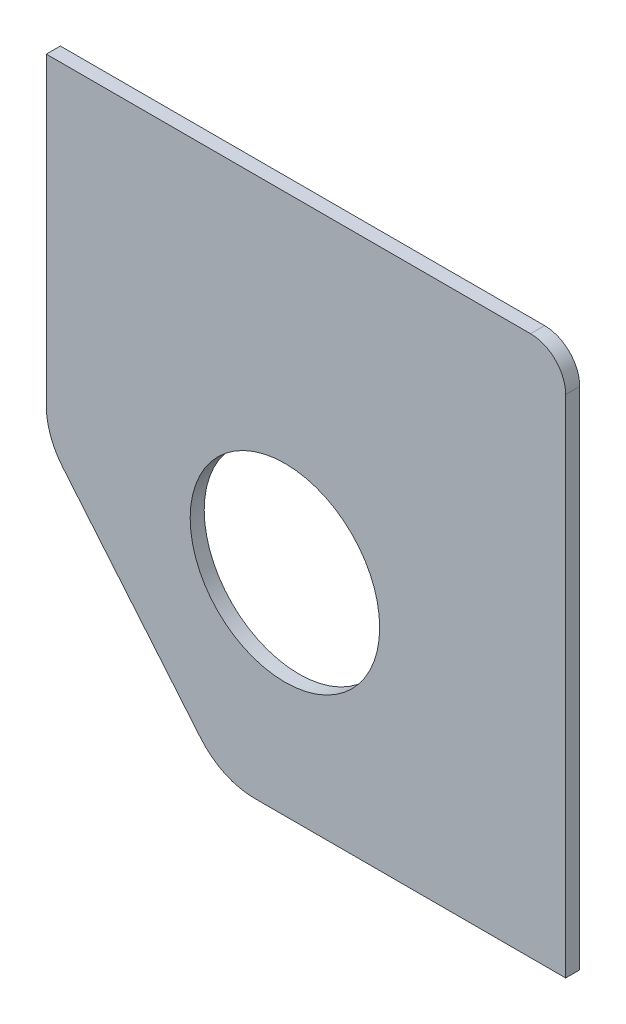
ISO-10303-21;
HEADER;
FILE_DESCRIPTION(('STEP AP214'),'2;1');
FILE_NAME('part.step','',(''),(''),'','','');
FILE_SCHEMA(('AUTOMOTIVE_DESIGN { 1 0 10303 214 1 1 1 1 }'));
ENDSEC;
DATA;
#1=APPLICATION_CONTEXT('core data for automotive mechanical design processes');
#2=APPLICATION_PROTOCOL_DEFINITION('international standard','automotive_design',2000,#1);
#3=PRODUCT_CONTEXT('',#1,'mechanical');
#4=PRODUCT('Part','Part','',(#3));
#5=PRODUCT_RELATED_PRODUCT_CATEGORY('part','',(#4));
#6=PRODUCT_DEFINITION_FORMATION('','',#4);
#7=PRODUCT_DEFINITION_CONTEXT('part definition',#1,'design');
#8=PRODUCT_DEFINITION('design','',#6,#7);
#9=PRODUCT_DEFINITION_SHAPE('','',#8);
#10=(LENGTH_UNIT() NAMED_UNIT(*) SI_UNIT(.MILLI.,.METRE.));
#11=(NAMED_UNIT(*) PLANE_ANGLE_UNIT() SI_UNIT($,.RADIAN.));
#12=(NAMED_UNIT(*) SI_UNIT($,.STERADIAN.) SOLID_ANGLE_UNIT());
#13=UNCERTAINTY_MEASURE_WITH_UNIT(LENGTH_MEASURE(1.E-05),#10,'distance_accuracy_value','');
#14=(GEOMETRIC_REPRESENTATION_CONTEXT(3) GLOBAL_UNCERTAINTY_ASSIGNED_CONTEXT((#13)) GLOBAL_UNIT_ASSIGNED_CONTEXT((#10,
#11,#12)) REPRESENTATION_CONTEXT('',''));
#15=CARTESIAN_POINT('',(0.,0.,0.));
#16=DIRECTION('',(0.,0.,1.));
#17=DIRECTION('',(1.,0.,0.));
#18=AXIS2_PLACEMENT_3D('',#15,#16,#17);
#19=CARTESIAN_POINT('',(-10.0111395817895,-38.1455223880597,2.));
#20=DIRECTION('',(0.,0.,-1.));
#21=DIRECTION('',(-1.,0.,0.));
#22=AXIS2_PLACEMENT_3D('',#19,#20,#21);
#23=CYLINDRICAL_SURFACE('',#22,10.);
#24=DIRECTION('',(0.,0.,-1.));
#25=VECTOR('',#24,1.);
#26=CARTESIAN_POINT('',(-10.0111395817895,-48.1455223880597,2.));
#27=LINE('',#26,#25);
#28=CARTESIAN_POINT('',(-10.0111395817895,-48.1455223880597,2.));
#29=VERTEX_POINT('',#28);
#30=CARTESIAN_POINT('',(-10.0111395817895,-48.1455223880597,0.));
#31=VERTEX_POINT('',#30);
#32=EDGE_CURVE('E155',#29,#31,#27,.T.);
#33=ORIENTED_EDGE('',*,*,#32,.F.);
#34=CARTESIAN_POINT('',(-10.0111395817895,-38.1455223880597,2.));
#35=DIRECTION('',(0.,0.,1.));
#36=DIRECTION('',(1.,0.,0.));
#37=AXIS2_PLACEMENT_3D('',#34,#35,#36);
#38=CIRCLE('',#37,10.);
#39=CARTESIAN_POINT('',(-17.6933523777633,-44.5473663847045,2.));
#40=VERTEX_POINT('',#39);
#41=EDGE_CURVE('E40',#40,#29,#38,.T.);
#42=ORIENTED_EDGE('',*,*,#41,.F.);
#43=DIRECTION('',(0.,0.,-1.));
#44=VECTOR('',#43,1.);
#45=CARTESIAN_POINT('',(-17.6933523777633,-44.5473663847045,138.016150708444));
#46=LINE('',#45,#44);
#47=CARTESIAN_POINT('',(-17.6933523777633,-44.5473663847045,0.));
#48=VERTEX_POINT('',#47);
#49=EDGE_CURVE('E157',#48,#40,#46,.F.);
#50=ORIENTED_EDGE('',*,*,#49,.F.);
#51=CARTESIAN_POINT('',(-10.0111395817895,-38.1455223880597,0.));
#52=DIRECTION('',(0.,0.,1.));
#53=DIRECTION('',(1.,0.,0.));
#54=AXIS2_PLACEMENT_3D('',#51,#52,#53);
#55=CIRCLE('',#54,10.);
#56=EDGE_CURVE('E11',#31,#48,#55,.F.);
#57=ORIENTED_EDGE('',*,*,#56,.F.);
#58=EDGE_LOOP('',(#33,#42,#50,#57));
#59=FACE_BOUND('',#58,.T.);
#60=ADVANCED_FACE('F33',(#59),#23,.T.);
#61=CARTESIAN_POINT('',(-29.6948890416339,-14.5250230362464,2.));
#62=DIRECTION('',(0.,0.,1.));
#63=DIRECTION('',(1.,0.,0.));
#64=AXIS2_PLACEMENT_3D('',#61,#62,#63);
#65=CYLINDRICAL_SURFACE('',#64,10.);
#66=DIRECTION('',(0.,0.,1.));
#67=VECTOR('',#66,1.);
#68=CARTESIAN_POINT('',(-39.6948890416339,-14.5250230362464,2.));
#69=LINE('',#68,#67);
#70=CARTESIAN_POINT('',(-39.6948890416339,-14.5250230362464,0.));
#71=VERTEX_POINT('',#70);
#72=CARTESIAN_POINT('',(-39.6948890416339,-14.5250230362464,2.));
#73=VERTEX_POINT('',#72);
#74=EDGE_CURVE('E144',#71,#73,#69,.T.);
#75=ORIENTED_EDGE('',*,*,#74,.F.);
#76=CARTESIAN_POINT('',(-29.6948890416339,-14.5250230362464,0.));
#77=DIRECTION('',(0.,0.,1.));
#78=DIRECTION('',(1.,0.,0.));
#79=AXIS2_PLACEMENT_3D('',#76,#77,#78);
#80=CIRCLE('',#79,10.);
#81=CARTESIAN_POINT('',(-37.3771018376077,-20.9268670328912,0.));
#82=VERTEX_POINT('',#81);
#83=EDGE_CURVE('E150',#82,#71,#80,.F.);
#84=ORIENTED_EDGE('',*,*,#83,.F.);
#85=DIRECTION('',(0.,0.,1.));
#86=VECTOR('',#85,1.);
#87=CARTESIAN_POINT('',(-37.3771018376077,-20.9268670328912,138.016150708444));
#88=LINE('',#87,#86);
#89=CARTESIAN_POINT('',(-37.3771018376077,-20.9268670328912,2.));
#90=VERTEX_POINT('',#89);
#91=EDGE_CURVE('E147',#90,#82,#88,.F.);
#92=ORIENTED_EDGE('',*,*,#91,.F.);
#93=CARTESIAN_POINT('',(-29.6948890416339,-14.5250230362464,2.));
#94=DIRECTION('',(0.,0.,1.));
#95=DIRECTION('',(1.,0.,0.));
#96=AXIS2_PLACEMENT_3D('',#93,#94,#95);
#97=CIRCLE('',#96,10.);
#98=EDGE_CURVE('E152',#73,#90,#97,.T.);
#99=ORIENTED_EDGE('',*,*,#98,.F.);
#100=EDGE_LOOP('',(#75,#84,#92,#99));
#101=FACE_BOUND('',#100,.T.);
#102=ADVANCED_FACE('F179',(#101),#65,.T.);
#103=CARTESIAN_POINT('',(29.3051109583661,23.8544776119403,2.));
#104=DIRECTION('',(0.,0.,1.));
#105=DIRECTION('',(1.,0.,0.));
#106=AXIS2_PLACEMENT_3D('',#103,#104,#105);
#107=CYLINDRICAL_SURFACE('',#106,5.);
#108=DIRECTION('',(0.,0.,1.));
#109=VECTOR('',#108,1.);
#110=CARTESIAN_POINT('',(34.3051109583661,23.8544776119403,2.));
#111=LINE('',#110,#109);
#112=CARTESIAN_POINT('',(34.3051109583661,23.8544776119403,0.));
#113=VERTEX_POINT('',#112);
#114=CARTESIAN_POINT('',(34.3051109583661,23.8544776119403,2.));
#115=VERTEX_POINT('',#114);
#116=EDGE_CURVE('E118',#113,#115,#111,.T.);
#117=ORIENTED_EDGE('',*,*,#116,.F.);
#118=CARTESIAN_POINT('',(29.3051109583661,23.8544776119403,0.));
#119=DIRECTION('',(0.,0.,1.));
#120=DIRECTION('',(1.,0.,0.));
#121=AXIS2_PLACEMENT_3D('',#118,#119,#120);
#122=CIRCLE('',#121,5.);
#123=CARTESIAN_POINT('',(29.3051109583661,28.8544776119403,0.));
#124=VERTEX_POINT('',#123);
#125=EDGE_CURVE('E140',#124,#113,#122,.F.);
#126=ORIENTED_EDGE('',*,*,#125,.F.);
#127=DIRECTION('',(0.,0.,1.));
#128=VECTOR('',#127,1.);
#129=CARTESIAN_POINT('',(29.3051109583661,28.8544776119403,2.));
#130=LINE('',#129,#128);
#131=CARTESIAN_POINT('',(29.3051109583661,28.8544776119403,2.));
#132=VERTEX_POINT('',#131);
#133=EDGE_CURVE('E137',#132,#124,#130,.F.);
#134=ORIENTED_EDGE('',*,*,#133,.F.);
#135=CARTESIAN_POINT('',(29.3051109583661,23.8544776119403,2.));
#136=DIRECTION('',(0.,0.,1.));
#137=DIRECTION('',(1.,0.,0.));
#138=AXIS2_PLACEMENT_3D('',#135,#136,#137);
#139=CIRCLE('',#138,5.);
#140=EDGE_CURVE('E142',#115,#132,#139,.T.);
#141=ORIENTED_EDGE('',*,*,#140,.F.);
#142=EDGE_LOOP('',(#117,#126,#134,#141));
#143=FACE_BOUND('',#142,.T.);
#144=ADVANCED_FACE('F186',(#143),#107,.T.);
#145=CARTESIAN_POINT('',(-39.6948890416339,28.8544776119403,2.));
#146=DIRECTION('',(1.,0.,0.));
#147=DIRECTION('',(0.,0.,-1.));
#148=AXIS2_PLACEMENT_3D('',#145,#146,#147);
#149=PLANE('',#148);
#150=DIRECTION('',(0.,-1.,0.));
#151=VECTOR('',#150,1.);
#152=CARTESIAN_POINT('',(-39.6948890416339,28.8544776119403,0.));
#153=LINE('',#152,#151);
#154=CARTESIAN_POINT('',(-39.6948890416339,28.8544776119403,0.));
#155=VERTEX_POINT('',#154);
#156=EDGE_CURVE('E124',#155,#71,#153,.T.);
#157=ORIENTED_EDGE('',*,*,#156,.T.);
#158=ORIENTED_EDGE('',*,*,#74,.T.);
#159=DIRECTION('',(0.,-1.,0.));
#160=VECTOR('',#159,1.);
#161=CARTESIAN_POINT('',(-39.6948890416339,28.8544776119403,2.));
#162=LINE('',#161,#160);
#163=CARTESIAN_POINT('',(-39.6948890416339,28.8544776119403,2.));
#164=VERTEX_POINT('',#163);
#165=EDGE_CURVE('E103',#164,#73,#162,.T.);
#166=ORIENTED_EDGE('',*,*,#165,.F.);
#167=DIRECTION('',(0.,0.,-1.));
#168=VECTOR('',#167,1.);
#169=CARTESIAN_POINT('',(-39.6948890416339,28.8544776119403,2.));
#170=LINE('',#169,#168);
#171=EDGE_CURVE('E113',#164,#155,#170,.T.);
#172=ORIENTED_EDGE('',*,*,#171,.T.);
#173=EDGE_LOOP('',(#157,#158,#166,#172));
#174=FACE_BOUND('',#173,.T.);
#175=ADVANCED_FACE('F174',(#174),#149,.F.);
#176=CARTESIAN_POINT('',(-39.6948890416339,-48.1455223880597,2.));
#177=DIRECTION('',(0.,1.,0.));
#178=DIRECTION('',(0.,0.,1.));
#179=AXIS2_PLACEMENT_3D('',#176,#177,#178);
#180=PLANE('',#179);
#181=DIRECTION('',(1.,0.,0.));
#182=VECTOR('',#181,1.);
#183=CARTESIAN_POINT('',(-39.6948890416339,-48.1455223880597,2.));
#184=LINE('',#183,#182);
#185=CARTESIAN_POINT('',(34.3051109583661,-48.1455223880597,2.));
#186=VERTEX_POINT('',#185);
#187=EDGE_CURVE('E94',#29,#186,#184,.T.);
#188=ORIENTED_EDGE('',*,*,#187,.F.);
#189=ORIENTED_EDGE('',*,*,#32,.T.);
#190=DIRECTION('',(1.,0.,0.));
#191=VECTOR('',#190,1.);
#192=CARTESIAN_POINT('',(-39.6948890416339,-48.1455223880597,0.));
#193=LINE('',#192,#191);
#194=CARTESIAN_POINT('',(34.3051109583661,-48.1455223880597,0.));
#195=VERTEX_POINT('',#194);
#196=EDGE_CURVE('E108',#31,#195,#193,.T.);
#197=ORIENTED_EDGE('',*,*,#196,.T.);
#198=DIRECTION('',(0.,0.,-1.));
#199=VECTOR('',#198,1.);
#200=CARTESIAN_POINT('',(34.3051109583661,-48.1455223880597,2.));
#201=LINE('',#200,#199);
#202=EDGE_CURVE('E106',#186,#195,#201,.T.);
#203=ORIENTED_EDGE('',*,*,#202,.F.);
#204=EDGE_LOOP('',(#188,#189,#197,#203));
#205=FACE_BOUND('',#204,.T.);
#206=ADVANCED_FACE('F107',(#205),#180,.F.);
#207=CARTESIAN_POINT('',(34.3051109583661,28.8544776119403,2.));
#208=DIRECTION('',(-1.,0.,0.));
#209=DIRECTION('',(0.,-1.,0.));
#210=AXIS2_PLACEMENT_3D('',#207,#208,#209);
#211=PLANE('',#210);
#212=DIRECTION('',(0.,1.,0.));
#213=VECTOR('',#212,1.);
#214=CARTESIAN_POINT('',(34.3051109583661,28.8544776119403,0.));
#215=LINE('',#214,#213);
#216=EDGE_CURVE('E129',#195,#113,#215,.T.);
#217=ORIENTED_EDGE('',*,*,#216,.T.);
#218=ORIENTED_EDGE('',*,*,#116,.T.);
#219=DIRECTION('',(0.,1.,0.));
#220=VECTOR('',#219,1.);
#221=CARTESIAN_POINT('',(34.3051109583661,28.8544776119403,2.));
#222=LINE('',#221,#220);
#223=EDGE_CURVE('E100',#186,#115,#222,.T.);
#224=ORIENTED_EDGE('',*,*,#223,.F.);
#225=ORIENTED_EDGE('',*,*,#202,.T.);
#226=EDGE_LOOP('',(#217,#218,#224,#225));
#227=FACE_BOUND('',#226,.T.);
#228=ADVANCED_FACE('F116',(#227),#211,.F.);
#229=CARTESIAN_POINT('',(-39.6948890416339,28.8544776119403,2.));
#230=DIRECTION('',(0.,-1.,0.));
#231=DIRECTION('',(0.,0.,-1.));
#232=AXIS2_PLACEMENT_3D('',#229,#230,#231);
#233=PLANE('',#232);
#234=DIRECTION('',(-1.,0.,0.));
#235=VECTOR('',#234,1.);
#236=CARTESIAN_POINT('',(-39.6948890416339,28.8544776119403,2.));
#237=LINE('',#236,#235);
#238=EDGE_CURVE('E119',#132,#164,#237,.T.);
#239=ORIENTED_EDGE('',*,*,#238,.F.);
#240=ORIENTED_EDGE('',*,*,#133,.T.);
#241=DIRECTION('',(-1.,0.,0.));
#242=VECTOR('',#241,1.);
#243=CARTESIAN_POINT('',(-39.6948890416339,28.8544776119403,0.));
#244=LINE('',#243,#242);
#245=EDGE_CURVE('E131',#124,#155,#244,.T.);
#246=ORIENTED_EDGE('',*,*,#245,.T.);
#247=ORIENTED_EDGE('',*,*,#171,.F.);
#248=EDGE_LOOP('',(#239,#240,#246,#247));
#249=FACE_BOUND('',#248,.T.);
#250=ADVANCED_FACE('F183',(#249),#233,.F.);
#251=CARTESIAN_POINT('',(0.,0.,2.));
#252=DIRECTION('',(0.,0.,1.));
#253=DIRECTION('',(1.,0.,0.));
#254=AXIS2_PLACEMENT_3D('',#251,#252,#253);
#255=PLANE('',#254);
#256=DIRECTION('',(-0.64018439966448,0.768221279597376,0.));
#257=VECTOR('',#256,1.);
#258=CARTESIAN_POINT('',(-32.3505192973871,-26.9587660811559,2.));
#259=LINE('',#258,#257);
#260=EDGE_CURVE('E161',#40,#90,#259,.T.);
#261=ORIENTED_EDGE('',*,*,#260,.F.);
#262=ORIENTED_EDGE('',*,*,#41,.T.);
#263=ORIENTED_EDGE('',*,*,#187,.T.);
#264=ORIENTED_EDGE('',*,*,#223,.T.);
#265=ORIENTED_EDGE('',*,*,#140,.T.);
#266=ORIENTED_EDGE('',*,*,#238,.T.);
#267=ORIENTED_EDGE('',*,*,#165,.T.);
#268=ORIENTED_EDGE('',*,*,#98,.T.);
#269=EDGE_LOOP('',(#261,#262,#263,#264,#265,#266,#267,#268));
#270=FACE_BOUND('',#269,.T.);
#271=CARTESIAN_POINT('',(-5.69488904163392,-18.1455223880597,2.));
#272=DIRECTION('',(0.,0.,1.));
#273=DIRECTION('',(1.,0.,0.));
#274=AXIS2_PLACEMENT_3D('',#271,#272,#273);
#275=CIRCLE('',#274,13.5);
#276=CARTESIAN_POINT('',(7.80511095836608,-18.1455223880597,2.));
#277=VERTEX_POINT('',#276);
#278=EDGE_CURVE('E164',#277,#277,#275,.T.);
#279=ORIENTED_EDGE('',*,*,#278,.F.);
#280=EDGE_LOOP('',(#279));
#281=FACE_BOUND('',#280,.T.);
#282=ADVANCED_FACE('F97',(#270,#281),#255,.T.);
#283=CARTESIAN_POINT('',(0.,0.,0.));
#284=DIRECTION('',(0.,0.,1.));
#285=DIRECTION('',(1.,0.,0.));
#286=AXIS2_PLACEMENT_3D('',#283,#284,#285);
#287=PLANE('',#286);
#288=CARTESIAN_POINT('',(-5.69488904163392,-18.1455223880597,0.));
#289=DIRECTION('',(0.,0.,1.));
#290=DIRECTION('',(1.,0.,0.));
#291=AXIS2_PLACEMENT_3D('',#288,#289,#290);
#292=CIRCLE('',#291,13.5);
#293=CARTESIAN_POINT('',(7.80511095836608,-18.1455223880597,0.));
#294=VERTEX_POINT('',#293);
#295=EDGE_CURVE('E127',#294,#294,#292,.T.);
#296=ORIENTED_EDGE('',*,*,#295,.T.);
#297=EDGE_LOOP('',(#296));
#298=FACE_BOUND('',#297,.T.);
#299=ORIENTED_EDGE('',*,*,#196,.F.);
#300=ORIENTED_EDGE('',*,*,#56,.T.);
#301=DIRECTION('',(-0.64018439966448,0.768221279597376,0.));
#302=VECTOR('',#301,1.);
#303=CARTESIAN_POINT('',(-32.3505192973871,-26.9587660811559,0.));
#304=LINE('',#303,#302);
#305=EDGE_CURVE('E112',#48,#82,#304,.T.);
#306=ORIENTED_EDGE('',*,*,#305,.T.);
#307=ORIENTED_EDGE('',*,*,#83,.T.);
#308=ORIENTED_EDGE('',*,*,#156,.F.);
#309=ORIENTED_EDGE('',*,*,#245,.F.);
#310=ORIENTED_EDGE('',*,*,#125,.T.);
#311=ORIENTED_EDGE('',*,*,#216,.F.);
#312=EDGE_LOOP('',(#299,#300,#306,#307,#308,#309,#310,#311));
#313=FACE_BOUND('',#312,.T.);
#314=ADVANCED_FACE('F180',(#298,#313),#287,.F.);
#315=CARTESIAN_POINT('',(-5.69488904163392,-18.1455223880597,0.));
#316=DIRECTION('',(0.,0.,1.));
#317=DIRECTION('',(1.,0.,0.));
#318=AXIS2_PLACEMENT_3D('',#315,#316,#317);
#319=CYLINDRICAL_SURFACE('',#318,13.5);
#320=ORIENTED_EDGE('',*,*,#295,.F.);
#321=EDGE_LOOP('',(#320));
#322=FACE_BOUND('',#321,.T.);
#323=ORIENTED_EDGE('',*,*,#278,.T.);
#324=EDGE_LOOP('',(#323));
#325=FACE_BOUND('',#324,.T.);
#326=ADVANCED_FACE('F240',(#322,#325),#319,.F.);
#327=CARTESIAN_POINT('',(-39.6948890416339,-18.1455223880597,138.016150708444));
#328=DIRECTION('',(0.768221279597376,0.64018439966448,0.));
#329=DIRECTION('',(-0.64018439966448,0.768221279597376,0.));
#330=AXIS2_PLACEMENT_3D('',#327,#328,#329);
#331=PLANE('',#330);
#332=ORIENTED_EDGE('',*,*,#305,.F.);
#333=ORIENTED_EDGE('',*,*,#49,.T.);
#334=ORIENTED_EDGE('',*,*,#260,.T.);
#335=ORIENTED_EDGE('',*,*,#91,.T.);
#336=EDGE_LOOP('',(#332,#333,#334,#335));
#337=FACE_BOUND('',#336,.T.);
#338=ADVANCED_FACE('F160',(#337),#331,.F.);
#339=CLOSED_SHELL('',(#60,#102,#144,#175,#206,#228,#250,#282,#314,#326,#338));
#340=MANIFOLD_SOLID_BREP('B2',#339);
#341=ADVANCED_BREP_SHAPE_REPRESENTATION('',(#18,#340),#14);
#342=SHAPE_DEFINITION_REPRESENTATION(#9,#341);
ENDSEC;
END-ISO-10303-21;
